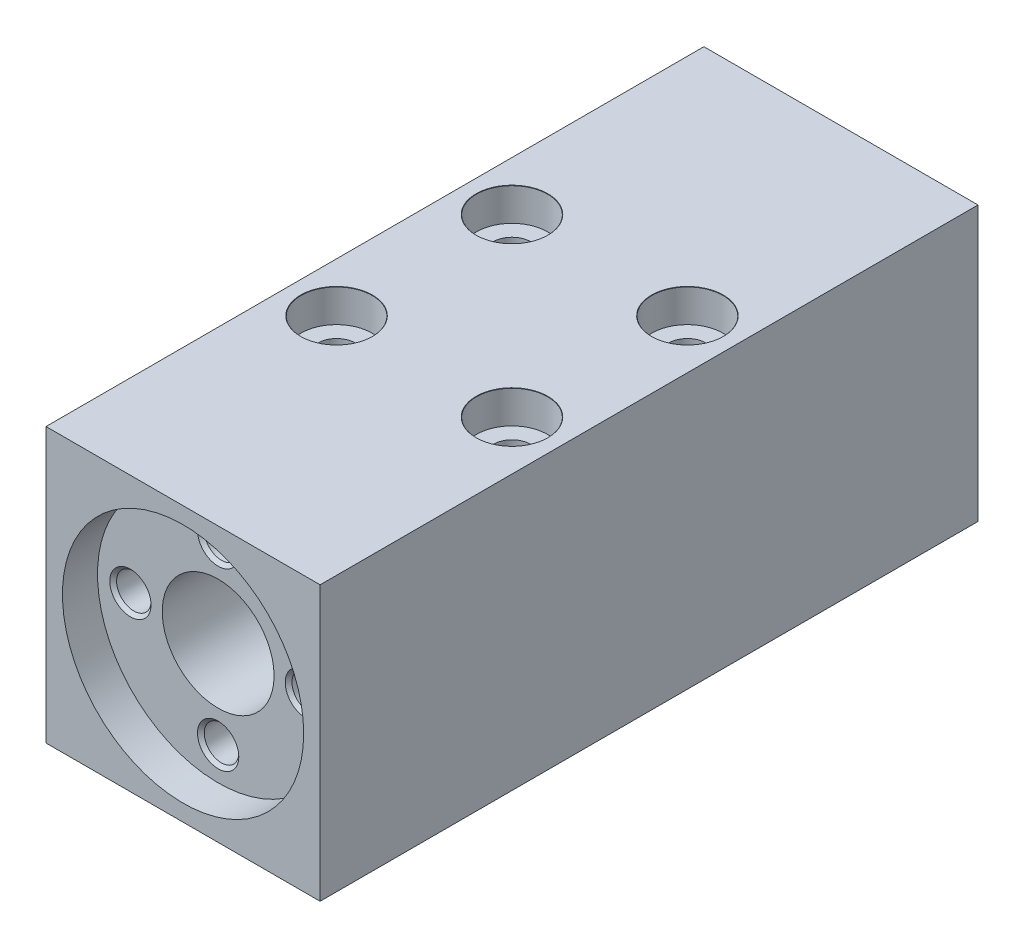
ISO-10303-21;
HEADER;
FILE_DESCRIPTION(('STEP AP214'),'2;1');
FILE_NAME('part.step','',(''),(''),'','','');
FILE_SCHEMA(('AUTOMOTIVE_DESIGN { 1 0 10303 214 1 1 1 1 }'));
ENDSEC;
DATA;
#1=APPLICATION_CONTEXT('core data for automotive mechanical design processes');
#2=APPLICATION_PROTOCOL_DEFINITION('international standard','automotive_design',2000,#1);
#3=PRODUCT_CONTEXT('',#1,'mechanical');
#4=PRODUCT('Part','Part','',(#3));
#5=PRODUCT_RELATED_PRODUCT_CATEGORY('part','',(#4));
#6=PRODUCT_DEFINITION_FORMATION('','',#4);
#7=PRODUCT_DEFINITION_CONTEXT('part definition',#1,'design');
#8=PRODUCT_DEFINITION('design','',#6,#7);
#9=PRODUCT_DEFINITION_SHAPE('','',#8);
#10=(LENGTH_UNIT() NAMED_UNIT(*) SI_UNIT(.MILLI.,.METRE.));
#11=(NAMED_UNIT(*) PLANE_ANGLE_UNIT() SI_UNIT($,.RADIAN.));
#12=(NAMED_UNIT(*) SI_UNIT($,.STERADIAN.) SOLID_ANGLE_UNIT());
#13=UNCERTAINTY_MEASURE_WITH_UNIT(LENGTH_MEASURE(1.E-05),#10,'distance_accuracy_value','');
#14=(GEOMETRIC_REPRESENTATION_CONTEXT(3) GLOBAL_UNCERTAINTY_ASSIGNED_CONTEXT((#13)) GLOBAL_UNIT_ASSIGNED_CONTEXT((#10,
#11,#12)) REPRESENTATION_CONTEXT('',''));
#15=CARTESIAN_POINT('',(0.,0.,0.));
#16=DIRECTION('',(0.,0.,1.));
#17=DIRECTION('',(1.,0.,0.));
#18=AXIS2_PLACEMENT_3D('',#15,#16,#17);
#19=CARTESIAN_POINT('',(0.,0.,0.));
#20=DIRECTION('',(0.,0.,1.));
#21=DIRECTION('',(1.,0.,0.));
#22=AXIS2_PLACEMENT_3D('',#19,#20,#21);
#23=CYLINDRICAL_SURFACE('',#22,5.1);
#24=CARTESIAN_POINT('',(0.,0.,0.));
#25=DIRECTION('',(0.,0.,1.));
#26=DIRECTION('',(1.,0.,0.));
#27=AXIS2_PLACEMENT_3D('',#24,#25,#26);
#28=CIRCLE('',#27,5.1);
#29=CARTESIAN_POINT('',(5.1,0.,0.));
#30=VERTEX_POINT('',#29);
#31=EDGE_CURVE('E168',#30,#30,#28,.T.);
#32=ORIENTED_EDGE('',*,*,#31,.F.);
#33=EDGE_LOOP('',(#32));
#34=FACE_BOUND('',#33,.T.);
#35=CARTESIAN_POINT('',(0.,0.,56.8));
#36=DIRECTION('',(0.,0.,1.));
#37=DIRECTION('',(1.,0.,0.));
#38=AXIS2_PLACEMENT_3D('',#35,#36,#37);
#39=CIRCLE('',#38,5.1);
#40=CARTESIAN_POINT('',(5.1,0.,56.8));
#41=VERTEX_POINT('',#40);
#42=EDGE_CURVE('E46',#41,#41,#39,.F.);
#43=ORIENTED_EDGE('',*,*,#42,.F.);
#44=EDGE_LOOP('',(#43));
#45=FACE_BOUND('',#44,.T.);
#46=ADVANCED_FACE('F42',(#34,#45),#23,.F.);
#47=CARTESIAN_POINT('',(-12.5,-12.5,60.));
#48=DIRECTION('',(1.,0.,0.));
#49=DIRECTION('',(0.,0.,-1.));
#50=AXIS2_PLACEMENT_3D('',#47,#48,#49);
#51=PLANE('',#50);
#52=DIRECTION('',(0.,-1.,0.));
#53=VECTOR('',#52,1.);
#54=CARTESIAN_POINT('',(-12.5,-12.5,0.));
#55=LINE('',#54,#53);
#56=CARTESIAN_POINT('',(-12.5,12.5,0.));
#57=VERTEX_POINT('',#56);
#58=CARTESIAN_POINT('',(-12.5,-12.5,0.));
#59=VERTEX_POINT('',#58);
#60=EDGE_CURVE('E172',#57,#59,#55,.T.);
#61=ORIENTED_EDGE('',*,*,#60,.T.);
#62=DIRECTION('',(0.,0.,-1.));
#63=VECTOR('',#62,1.);
#64=CARTESIAN_POINT('',(-12.5,-12.5,60.));
#65=LINE('',#64,#63);
#66=CARTESIAN_POINT('',(-12.5,-12.5,60.));
#67=VERTEX_POINT('',#66);
#68=EDGE_CURVE('E11',#67,#59,#65,.T.);
#69=ORIENTED_EDGE('',*,*,#68,.F.);
#70=DIRECTION('',(0.,-1.,0.));
#71=VECTOR('',#70,1.);
#72=CARTESIAN_POINT('',(-12.5,-12.5,60.));
#73=LINE('',#72,#71);
#74=CARTESIAN_POINT('',(-12.5,12.5,60.));
#75=VERTEX_POINT('',#74);
#76=EDGE_CURVE('E173',#75,#67,#73,.T.);
#77=ORIENTED_EDGE('',*,*,#76,.F.);
#78=DIRECTION('',(0.,0.,-1.));
#79=VECTOR('',#78,1.);
#80=CARTESIAN_POINT('',(-12.5,12.5,60.));
#81=LINE('',#80,#79);
#82=EDGE_CURVE('E183',#75,#57,#81,.T.);
#83=ORIENTED_EDGE('',*,*,#82,.T.);
#84=EDGE_LOOP('',(#61,#69,#77,#83));
#85=FACE_BOUND('',#84,.T.);
#86=ADVANCED_FACE('F44',(#85),#51,.F.);
#87=CARTESIAN_POINT('',(12.5,-12.5,60.));
#88=DIRECTION('',(0.,1.,0.));
#89=DIRECTION('',(-1.,0.,0.));
#90=AXIS2_PLACEMENT_3D('',#87,#88,#89);
#91=PLANE('',#90);
#92=CARTESIAN_POINT('',(-8.,-12.5,22.));
#93=DIRECTION('',(0.,1.,0.));
#94=DIRECTION('',(0.,0.,1.));
#95=AXIS2_PLACEMENT_3D('',#92,#93,#94);
#96=CIRCLE('',#95,1.69999999999999);
#97=CARTESIAN_POINT('',(-8.,-12.5,23.7));
#98=VERTEX_POINT('',#97);
#99=EDGE_CURVE('E376',#98,#98,#96,.T.);
#100=ORIENTED_EDGE('',*,*,#99,.T.);
#101=EDGE_LOOP('',(#100));
#102=FACE_BOUND('',#101,.T.);
#103=CARTESIAN_POINT('',(8.,-12.5,22.));
#104=DIRECTION('',(0.,1.,0.));
#105=DIRECTION('',(0.,0.,1.));
#106=AXIS2_PLACEMENT_3D('',#103,#104,#105);
#107=CIRCLE('',#106,1.69999999999999);
#108=CARTESIAN_POINT('',(8.,-12.5,23.7));
#109=VERTEX_POINT('',#108);
#110=EDGE_CURVE('E396',#109,#109,#107,.T.);
#111=ORIENTED_EDGE('',*,*,#110,.T.);
#112=EDGE_LOOP('',(#111));
#113=FACE_BOUND('',#112,.T.);
#114=CARTESIAN_POINT('',(-8.,-12.5,38.));
#115=DIRECTION('',(0.,1.,0.));
#116=DIRECTION('',(0.,0.,1.));
#117=AXIS2_PLACEMENT_3D('',#114,#115,#116);
#118=CIRCLE('',#117,1.69999999999999);
#119=CARTESIAN_POINT('',(-8.,-12.5,39.7));
#120=VERTEX_POINT('',#119);
#121=EDGE_CURVE('E416',#120,#120,#118,.T.);
#122=ORIENTED_EDGE('',*,*,#121,.T.);
#123=EDGE_LOOP('',(#122));
#124=FACE_BOUND('',#123,.T.);
#125=CARTESIAN_POINT('',(8.,-12.5,38.));
#126=DIRECTION('',(0.,1.,0.));
#127=DIRECTION('',(0.,0.,1.));
#128=AXIS2_PLACEMENT_3D('',#125,#126,#127);
#129=CIRCLE('',#128,1.69999999999999);
#130=CARTESIAN_POINT('',(8.,-12.5,39.7));
#131=VERTEX_POINT('',#130);
#132=EDGE_CURVE('E436',#131,#131,#129,.T.);
#133=ORIENTED_EDGE('',*,*,#132,.T.);
#134=EDGE_LOOP('',(#133));
#135=FACE_BOUND('',#134,.T.);
#136=DIRECTION('',(1.,0.,0.));
#137=VECTOR('',#136,1.);
#138=CARTESIAN_POINT('',(12.5,-12.5,0.));
#139=LINE('',#138,#137);
#140=CARTESIAN_POINT('',(12.5,-12.5,0.));
#141=VERTEX_POINT('',#140);
#142=EDGE_CURVE('E187',#59,#141,#139,.T.);
#143=ORIENTED_EDGE('',*,*,#142,.T.);
#144=DIRECTION('',(0.,0.,-1.));
#145=VECTOR('',#144,1.);
#146=CARTESIAN_POINT('',(12.5,-12.5,60.));
#147=LINE('',#146,#145);
#148=CARTESIAN_POINT('',(12.5,-12.5,60.));
#149=VERTEX_POINT('',#148);
#150=EDGE_CURVE('E53',#149,#141,#147,.T.);
#151=ORIENTED_EDGE('',*,*,#150,.F.);
#152=DIRECTION('',(1.,0.,0.));
#153=VECTOR('',#152,1.);
#154=CARTESIAN_POINT('',(12.5,-12.5,60.));
#155=LINE('',#154,#153);
#156=EDGE_CURVE('E92',#67,#149,#155,.T.);
#157=ORIENTED_EDGE('',*,*,#156,.F.);
#158=ORIENTED_EDGE('',*,*,#68,.T.);
#159=EDGE_LOOP('',(#143,#151,#157,#158));
#160=FACE_BOUND('',#159,.T.);
#161=ADVANCED_FACE('F221',(#102,#113,#124,#135,#160),#91,.F.);
#162=CARTESIAN_POINT('',(12.5,-12.5,60.));
#163=DIRECTION('',(-1.,0.,0.));
#164=DIRECTION('',(0.,0.,1.));
#165=AXIS2_PLACEMENT_3D('',#162,#163,#164);
#166=PLANE('',#165);
#167=DIRECTION('',(0.,1.,0.));
#168=VECTOR('',#167,1.);
#169=CARTESIAN_POINT('',(12.5,-12.5,0.));
#170=LINE('',#169,#168);
#171=CARTESIAN_POINT('',(12.5,12.5,0.));
#172=VERTEX_POINT('',#171);
#173=EDGE_CURVE('E79',#141,#172,#170,.T.);
#174=ORIENTED_EDGE('',*,*,#173,.T.);
#175=DIRECTION('',(0.,0.,-1.));
#176=VECTOR('',#175,1.);
#177=CARTESIAN_POINT('',(12.5,12.5,60.));
#178=LINE('',#177,#176);
#179=CARTESIAN_POINT('',(12.5,12.5,60.));
#180=VERTEX_POINT('',#179);
#181=EDGE_CURVE('E196',#180,#172,#178,.T.);
#182=ORIENTED_EDGE('',*,*,#181,.F.);
#183=DIRECTION('',(0.,1.,0.));
#184=VECTOR('',#183,1.);
#185=CARTESIAN_POINT('',(12.5,-12.5,60.));
#186=LINE('',#185,#184);
#187=EDGE_CURVE('E178',#149,#180,#186,.T.);
#188=ORIENTED_EDGE('',*,*,#187,.F.);
#189=ORIENTED_EDGE('',*,*,#150,.T.);
#190=EDGE_LOOP('',(#174,#182,#188,#189));
#191=FACE_BOUND('',#190,.T.);
#192=ADVANCED_FACE('F201',(#191),#166,.F.);
#193=CARTESIAN_POINT('',(12.5,12.5,60.));
#194=DIRECTION('',(0.,-1.,0.));
#195=DIRECTION('',(1.,0.,0.));
#196=AXIS2_PLACEMENT_3D('',#193,#194,#195);
#197=PLANE('',#196);
#198=CARTESIAN_POINT('',(-8.,12.5,22.));
#199=DIRECTION('',(0.,1.,0.));
#200=DIRECTION('',(0.,0.,1.));
#201=AXIS2_PLACEMENT_3D('',#198,#199,#200);
#202=CIRCLE('',#201,3.275);
#203=CARTESIAN_POINT('',(-8.,12.5,25.275));
#204=VERTEX_POINT('',#203);
#205=EDGE_CURVE('E362',#204,#204,#202,.T.);
#206=ORIENTED_EDGE('',*,*,#205,.F.);
#207=EDGE_LOOP('',(#206));
#208=FACE_BOUND('',#207,.T.);
#209=CARTESIAN_POINT('',(8.,12.5,22.));
#210=DIRECTION('',(0.,1.,0.));
#211=DIRECTION('',(0.,0.,1.));
#212=AXIS2_PLACEMENT_3D('',#209,#210,#211);
#213=CIRCLE('',#212,3.275);
#214=CARTESIAN_POINT('',(8.,12.5,25.275));
#215=VERTEX_POINT('',#214);
#216=EDGE_CURVE('E380',#215,#215,#213,.T.);
#217=ORIENTED_EDGE('',*,*,#216,.F.);
#218=EDGE_LOOP('',(#217));
#219=FACE_BOUND('',#218,.T.);
#220=CARTESIAN_POINT('',(-8.,12.5,38.));
#221=DIRECTION('',(0.,1.,0.));
#222=DIRECTION('',(0.,0.,1.));
#223=AXIS2_PLACEMENT_3D('',#220,#221,#222);
#224=CIRCLE('',#223,3.275);
#225=CARTESIAN_POINT('',(-8.,12.5,41.275));
#226=VERTEX_POINT('',#225);
#227=EDGE_CURVE('E400',#226,#226,#224,.T.);
#228=ORIENTED_EDGE('',*,*,#227,.F.);
#229=EDGE_LOOP('',(#228));
#230=FACE_BOUND('',#229,.T.);
#231=CARTESIAN_POINT('',(8.,12.5,38.));
#232=DIRECTION('',(0.,1.,0.));
#233=DIRECTION('',(0.,0.,1.));
#234=AXIS2_PLACEMENT_3D('',#231,#232,#233);
#235=CIRCLE('',#234,3.275);
#236=CARTESIAN_POINT('',(8.,12.5,41.275));
#237=VERTEX_POINT('',#236);
#238=EDGE_CURVE('E420',#237,#237,#235,.T.);
#239=ORIENTED_EDGE('',*,*,#238,.F.);
#240=EDGE_LOOP('',(#239));
#241=FACE_BOUND('',#240,.T.);
#242=DIRECTION('',(-1.,0.,0.));
#243=VECTOR('',#242,1.);
#244=CARTESIAN_POINT('',(12.5,12.5,0.));
#245=LINE('',#244,#243);
#246=EDGE_CURVE('E85',#172,#57,#245,.T.);
#247=ORIENTED_EDGE('',*,*,#246,.T.);
#248=ORIENTED_EDGE('',*,*,#82,.F.);
#249=DIRECTION('',(-1.,0.,0.));
#250=VECTOR('',#249,1.);
#251=CARTESIAN_POINT('',(12.5,12.5,60.));
#252=LINE('',#251,#250);
#253=EDGE_CURVE('E61',#180,#75,#252,.T.);
#254=ORIENTED_EDGE('',*,*,#253,.F.);
#255=ORIENTED_EDGE('',*,*,#181,.T.);
#256=EDGE_LOOP('',(#247,#248,#254,#255));
#257=FACE_BOUND('',#256,.T.);
#258=ADVANCED_FACE('F208',(#208,#219,#230,#241,#257),#197,.F.);
#259=CARTESIAN_POINT('',(0.,0.,60.));
#260=DIRECTION('',(0.,0.,1.));
#261=DIRECTION('',(1.,0.,0.));
#262=AXIS2_PLACEMENT_3D('',#259,#260,#261);
#263=PLANE('',#262);
#264=CARTESIAN_POINT('',(0.,0.,60.));
#265=DIRECTION('',(0.,0.,1.));
#266=DIRECTION('',(1.,0.,0.));
#267=AXIS2_PLACEMENT_3D('',#264,#265,#266);
#268=CIRCLE('',#267,11.);
#269=CARTESIAN_POINT('',(11.,0.,60.));
#270=VERTEX_POINT('',#269);
#271=EDGE_CURVE('E160',#270,#270,#268,.T.);
#272=ORIENTED_EDGE('',*,*,#271,.F.);
#273=EDGE_LOOP('',(#272));
#274=FACE_BOUND('',#273,.T.);
#275=ORIENTED_EDGE('',*,*,#76,.T.);
#276=ORIENTED_EDGE('',*,*,#156,.T.);
#277=ORIENTED_EDGE('',*,*,#187,.T.);
#278=ORIENTED_EDGE('',*,*,#253,.T.);
#279=EDGE_LOOP('',(#275,#276,#277,#278));
#280=FACE_BOUND('',#279,.T.);
#281=ADVANCED_FACE('F210',(#274,#280),#263,.T.);
#282=CARTESIAN_POINT('',(0.,0.,0.));
#283=DIRECTION('',(0.,0.,1.));
#284=DIRECTION('',(1.,0.,0.));
#285=AXIS2_PLACEMENT_3D('',#282,#283,#284);
#286=PLANE('',#285);
#287=ORIENTED_EDGE('',*,*,#31,.T.);
#288=EDGE_LOOP('',(#287));
#289=FACE_BOUND('',#288,.T.);
#290=ORIENTED_EDGE('',*,*,#60,.F.);
#291=ORIENTED_EDGE('',*,*,#246,.F.);
#292=ORIENTED_EDGE('',*,*,#173,.F.);
#293=ORIENTED_EDGE('',*,*,#142,.F.);
#294=EDGE_LOOP('',(#290,#291,#292,#293));
#295=FACE_BOUND('',#294,.T.);
#296=ADVANCED_FACE('F204',(#289,#295),#286,.F.);
#297=CARTESIAN_POINT('',(0.,0.,56.8));
#298=DIRECTION('',(0.,0.,1.));
#299=DIRECTION('',(1.,0.,0.));
#300=AXIS2_PLACEMENT_3D('',#297,#298,#299);
#301=PLANE('',#300);
#302=CARTESIAN_POINT('',(0.,8.,56.8));
#303=DIRECTION('',(0.,0.,1.));
#304=DIRECTION('',(1.,0.,0.));
#305=AXIS2_PLACEMENT_3D('',#302,#303,#304);
#306=CIRCLE('',#305,1.883);
#307=CARTESIAN_POINT('',(1.883,8.,56.8));
#308=VERTEX_POINT('',#307);
#309=EDGE_CURVE('E125',#308,#308,#306,.T.);
#310=ORIENTED_EDGE('',*,*,#309,.F.);
#311=EDGE_LOOP('',(#310));
#312=FACE_BOUND('',#311,.T.);
#313=CARTESIAN_POINT('',(8.00000000000023,2.25904099284255E-13,56.8));
#314=DIRECTION('',(0.,0.,1.));
#315=DIRECTION('',(1.,0.,0.));
#316=AXIS2_PLACEMENT_3D('',#313,#314,#315);
#317=CIRCLE('',#316,1.883);
#318=CARTESIAN_POINT('',(9.88300000000022,2.25904099284255E-13,56.8));
#319=VERTEX_POINT('',#318);
#320=EDGE_CURVE('E116',#319,#319,#317,.T.);
#321=ORIENTED_EDGE('',*,*,#320,.F.);
#322=EDGE_LOOP('',(#321));
#323=FACE_BOUND('',#322,.T.);
#324=CARTESIAN_POINT('',(4.51808198568511E-13,-8.,56.8));
#325=DIRECTION('',(0.,0.,1.));
#326=DIRECTION('',(1.,0.,0.));
#327=AXIS2_PLACEMENT_3D('',#324,#325,#326);
#328=CIRCLE('',#327,1.883);
#329=CARTESIAN_POINT('',(1.88300000000045,-8.,56.8));
#330=VERTEX_POINT('',#329);
#331=EDGE_CURVE('E136',#330,#330,#328,.T.);
#332=ORIENTED_EDGE('',*,*,#331,.F.);
#333=EDGE_LOOP('',(#332));
#334=FACE_BOUND('',#333,.T.);
#335=CARTESIAN_POINT('',(-7.99999999999977,-2.24924381844937E-13,56.8));
#336=DIRECTION('',(0.,0.,1.));
#337=DIRECTION('',(1.,0.,0.));
#338=AXIS2_PLACEMENT_3D('',#335,#336,#337);
#339=CIRCLE('',#338,1.883);
#340=CARTESIAN_POINT('',(-6.11699999999978,-2.24924381844937E-13,56.8));
#341=VERTEX_POINT('',#340);
#342=EDGE_CURVE('E148',#341,#341,#339,.T.);
#343=ORIENTED_EDGE('',*,*,#342,.F.);
#344=EDGE_LOOP('',(#343));
#345=FACE_BOUND('',#344,.T.);
#346=CARTESIAN_POINT('',(0.,0.,56.8));
#347=DIRECTION('',(0.,0.,1.));
#348=DIRECTION('',(1.,0.,0.));
#349=AXIS2_PLACEMENT_3D('',#346,#347,#348);
#350=CIRCLE('',#349,11.);
#351=CARTESIAN_POINT('',(11.,0.,56.8));
#352=VERTEX_POINT('',#351);
#353=EDGE_CURVE('E161',#352,#352,#350,.T.);
#354=ORIENTED_EDGE('',*,*,#353,.T.);
#355=EDGE_LOOP('',(#354));
#356=FACE_BOUND('',#355,.T.);
#357=ORIENTED_EDGE('',*,*,#42,.T.);
#358=EDGE_LOOP('',(#357));
#359=FACE_BOUND('',#358,.T.);
#360=ADVANCED_FACE('F238',(#312,#323,#334,#345,#356,#359),#301,.T.);
#361=CARTESIAN_POINT('',(0.,0.,56.8));
#362=DIRECTION('',(0.,0.,1.));
#363=DIRECTION('',(1.,0.,0.));
#364=AXIS2_PLACEMENT_3D('',#361,#362,#363);
#365=CYLINDRICAL_SURFACE('',#364,11.);
#366=ORIENTED_EDGE('',*,*,#353,.F.);
#367=EDGE_LOOP('',(#366));
#368=FACE_BOUND('',#367,.T.);
#369=ORIENTED_EDGE('',*,*,#271,.T.);
#370=EDGE_LOOP('',(#369));
#371=FACE_BOUND('',#370,.T.);
#372=ADVANCED_FACE('F235',(#368,#371),#365,.F.);
#373=CARTESIAN_POINT('',(-7.99999999999977,-2.24924381844937E-13,50.8));
#374=DIRECTION('',(0.,0.,1.));
#375=DIRECTION('',(1.,0.,0.));
#376=AXIS2_PLACEMENT_3D('',#373,#374,#375);
#377=CONICAL_SURFACE('',#376,1.575,1.02974425867665);
#378=CARTESIAN_POINT('',(-7.99999999999978,-2.24924381844937E-13,49.8536445250316));
#379=VERTEX_POINT('',#378);
#380=VERTEX_LOOP('',#379);
#381=FACE_BOUND('',#380,.T.);
#382=CARTESIAN_POINT('',(-7.99999999999977,-2.24924381844937E-13,50.8));
#383=DIRECTION('',(0.,0.,1.));
#384=DIRECTION('',(1.,0.,0.));
#385=AXIS2_PLACEMENT_3D('',#382,#383,#384);
#386=CIRCLE('',#385,1.575);
#387=CARTESIAN_POINT('',(-6.42499999999978,-2.24924381844937E-13,50.8));
#388=VERTEX_POINT('',#387);
#389=EDGE_CURVE('E156',#388,#388,#386,.T.);
#390=ORIENTED_EDGE('',*,*,#389,.T.);
#391=EDGE_LOOP('',(#390));
#392=FACE_BOUND('',#391,.T.);
#393=ADVANCED_FACE('F247',(#381,#392),#377,.F.);
#394=CARTESIAN_POINT('',(-7.99999999999977,-2.24924381844937E-13,56.8));
#395=DIRECTION('',(0.,0.,1.));
#396=DIRECTION('',(1.,0.,0.));
#397=AXIS2_PLACEMENT_3D('',#394,#395,#396);
#398=CYLINDRICAL_SURFACE('',#397,1.575);
#399=ORIENTED_EDGE('',*,*,#389,.F.);
#400=EDGE_LOOP('',(#399));
#401=FACE_BOUND('',#400,.T.);
#402=CARTESIAN_POINT('',(-7.99999999999977,-2.24924381844937E-13,56.492));
#403=DIRECTION('',(0.,0.,1.));
#404=DIRECTION('',(1.,0.,0.));
#405=AXIS2_PLACEMENT_3D('',#402,#403,#404);
#406=CIRCLE('',#405,1.575);
#407=CARTESIAN_POINT('',(-6.42499999999978,-2.24924381844937E-13,56.492));
#408=VERTEX_POINT('',#407);
#409=EDGE_CURVE('E152',#408,#408,#406,.T.);
#410=ORIENTED_EDGE('',*,*,#409,.T.);
#411=EDGE_LOOP('',(#410));
#412=FACE_BOUND('',#411,.T.);
#413=ADVANCED_FACE('F254',(#401,#412),#398,.F.);
#414=CARTESIAN_POINT('',(-7.99999999999977,-2.24924381844937E-13,56.8));
#415=DIRECTION('',(0.,0.,1.));
#416=DIRECTION('',(1.,0.,0.));
#417=AXIS2_PLACEMENT_3D('',#414,#415,#416);
#418=CONICAL_SURFACE('',#417,1.883,0.785398163397444);
#419=ORIENTED_EDGE('',*,*,#409,.F.);
#420=EDGE_LOOP('',(#419));
#421=FACE_BOUND('',#420,.T.);
#422=ORIENTED_EDGE('',*,*,#342,.T.);
#423=EDGE_LOOP('',(#422));
#424=FACE_BOUND('',#423,.T.);
#425=ADVANCED_FACE('F258',(#421,#424),#418,.F.);
#426=CARTESIAN_POINT('',(4.51808198568511E-13,-8.,50.8));
#427=DIRECTION('',(0.,0.,1.));
#428=DIRECTION('',(1.,0.,0.));
#429=AXIS2_PLACEMENT_3D('',#426,#427,#428);
#430=CONICAL_SURFACE('',#429,1.575,1.02974425867665);
#431=CARTESIAN_POINT('',(4.50106832168879E-13,-8.,49.8536445250316));
#432=VERTEX_POINT('',#431);
#433=VERTEX_LOOP('',#432);
#434=FACE_BOUND('',#433,.T.);
#435=CARTESIAN_POINT('',(4.51808198568511E-13,-8.,50.8));
#436=DIRECTION('',(0.,0.,1.));
#437=DIRECTION('',(1.,0.,0.));
#438=AXIS2_PLACEMENT_3D('',#435,#436,#437);
#439=CIRCLE('',#438,1.575);
#440=CARTESIAN_POINT('',(1.57500000000045,-8.,50.8));
#441=VERTEX_POINT('',#440);
#442=EDGE_CURVE('E144',#441,#441,#439,.T.);
#443=ORIENTED_EDGE('',*,*,#442,.T.);
#444=EDGE_LOOP('',(#443));
#445=FACE_BOUND('',#444,.T.);
#446=ADVANCED_FACE('F262',(#434,#445),#430,.F.);
#447=CARTESIAN_POINT('',(4.51808198568511E-13,-8.,56.8));
#448=DIRECTION('',(0.,0.,1.));
#449=DIRECTION('',(1.,0.,0.));
#450=AXIS2_PLACEMENT_3D('',#447,#448,#449);
#451=CYLINDRICAL_SURFACE('',#450,1.575);
#452=ORIENTED_EDGE('',*,*,#442,.F.);
#453=EDGE_LOOP('',(#452));
#454=FACE_BOUND('',#453,.T.);
#455=CARTESIAN_POINT('',(4.51808198568511E-13,-8.,56.492));
#456=DIRECTION('',(0.,0.,1.));
#457=DIRECTION('',(1.,0.,0.));
#458=AXIS2_PLACEMENT_3D('',#455,#456,#457);
#459=CIRCLE('',#458,1.575);
#460=CARTESIAN_POINT('',(1.57500000000045,-8.,56.492));
#461=VERTEX_POINT('',#460);
#462=EDGE_CURVE('E140',#461,#461,#459,.T.);
#463=ORIENTED_EDGE('',*,*,#462,.T.);
#464=EDGE_LOOP('',(#463));
#465=FACE_BOUND('',#464,.T.);
#466=ADVANCED_FACE('F266',(#454,#465),#451,.F.);
#467=CARTESIAN_POINT('',(4.51808198568511E-13,-8.,56.8));
#468=DIRECTION('',(0.,0.,1.));
#469=DIRECTION('',(1.,0.,0.));
#470=AXIS2_PLACEMENT_3D('',#467,#468,#469);
#471=CONICAL_SURFACE('',#470,1.883,0.785398163397444);
#472=ORIENTED_EDGE('',*,*,#462,.F.);
#473=EDGE_LOOP('',(#472));
#474=FACE_BOUND('',#473,.T.);
#475=ORIENTED_EDGE('',*,*,#331,.T.);
#476=EDGE_LOOP('',(#475));
#477=FACE_BOUND('',#476,.T.);
#478=ADVANCED_FACE('F270',(#474,#477),#471,.F.);
#479=CARTESIAN_POINT('',(8.00000000000023,2.25904099284255E-13,50.8));
#480=DIRECTION('',(0.,0.,1.));
#481=DIRECTION('',(1.,0.,0.));
#482=AXIS2_PLACEMENT_3D('',#479,#480,#481);
#483=CONICAL_SURFACE('',#482,1.575,1.02974425867665);
#484=CARTESIAN_POINT('',(8.00000000000022,2.25904099284255E-13,49.8536445250316));
#485=VERTEX_POINT('',#484);
#486=VERTEX_LOOP('',#485);
#487=FACE_BOUND('',#486,.T.);
#488=CARTESIAN_POINT('',(8.00000000000023,2.25904099284255E-13,50.8));
#489=DIRECTION('',(0.,0.,1.));
#490=DIRECTION('',(1.,0.,0.));
#491=AXIS2_PLACEMENT_3D('',#488,#489,#490);
#492=CIRCLE('',#491,1.575);
#493=CARTESIAN_POINT('',(9.57500000000022,2.25904099284255E-13,50.8));
#494=VERTEX_POINT('',#493);
#495=EDGE_CURVE('E132',#494,#494,#492,.T.);
#496=ORIENTED_EDGE('',*,*,#495,.T.);
#497=EDGE_LOOP('',(#496));
#498=FACE_BOUND('',#497,.T.);
#499=ADVANCED_FACE('F274',(#487,#498),#483,.F.);
#500=CARTESIAN_POINT('',(8.00000000000023,2.25904099284255E-13,56.8));
#501=DIRECTION('',(0.,0.,1.));
#502=DIRECTION('',(1.,0.,0.));
#503=AXIS2_PLACEMENT_3D('',#500,#501,#502);
#504=CYLINDRICAL_SURFACE('',#503,1.575);
#505=ORIENTED_EDGE('',*,*,#495,.F.);
#506=EDGE_LOOP('',(#505));
#507=FACE_BOUND('',#506,.T.);
#508=CARTESIAN_POINT('',(8.00000000000023,2.25904099284255E-13,56.492));
#509=DIRECTION('',(0.,0.,1.));
#510=DIRECTION('',(1.,0.,0.));
#511=AXIS2_PLACEMENT_3D('',#508,#509,#510);
#512=CIRCLE('',#511,1.575);
#513=CARTESIAN_POINT('',(9.57500000000022,2.25904099284255E-13,56.492));
#514=VERTEX_POINT('',#513);
#515=EDGE_CURVE('E122',#514,#514,#512,.T.);
#516=ORIENTED_EDGE('',*,*,#515,.T.);
#517=EDGE_LOOP('',(#516));
#518=FACE_BOUND('',#517,.T.);
#519=ADVANCED_FACE('F278',(#507,#518),#504,.F.);
#520=CARTESIAN_POINT('',(8.00000000000023,2.25904099284255E-13,56.8));
#521=DIRECTION('',(0.,0.,1.));
#522=DIRECTION('',(1.,0.,0.));
#523=AXIS2_PLACEMENT_3D('',#520,#521,#522);
#524=CONICAL_SURFACE('',#523,1.883,0.785398163397443);
#525=ORIENTED_EDGE('',*,*,#515,.F.);
#526=EDGE_LOOP('',(#525));
#527=FACE_BOUND('',#526,.T.);
#528=ORIENTED_EDGE('',*,*,#320,.T.);
#529=EDGE_LOOP('',(#528));
#530=FACE_BOUND('',#529,.T.);
#531=ADVANCED_FACE('F109',(#527,#530),#524,.F.);
#532=CARTESIAN_POINT('',(0.,8.,50.8));
#533=DIRECTION('',(0.,0.,1.));
#534=DIRECTION('',(1.,0.,0.));
#535=AXIS2_PLACEMENT_3D('',#532,#533,#534);
#536=CONICAL_SURFACE('',#535,1.575,1.02974425867665);
#537=CARTESIAN_POINT('',(0.,8.,49.8536445250316));
#538=VERTEX_POINT('',#537);
#539=VERTEX_LOOP('',#538);
#540=FACE_BOUND('',#539,.T.);
#541=CARTESIAN_POINT('',(0.,8.,50.8));
#542=DIRECTION('',(0.,0.,1.));
#543=DIRECTION('',(1.,0.,0.));
#544=AXIS2_PLACEMENT_3D('',#541,#542,#543);
#545=CIRCLE('',#544,1.575);
#546=CARTESIAN_POINT('',(1.575,8.,50.8));
#547=VERTEX_POINT('',#546);
#548=EDGE_CURVE('E113',#547,#547,#545,.T.);
#549=ORIENTED_EDGE('',*,*,#548,.T.);
#550=EDGE_LOOP('',(#549));
#551=FACE_BOUND('',#550,.T.);
#552=ADVANCED_FACE('F105',(#540,#551),#536,.F.);
#553=CARTESIAN_POINT('',(0.,8.,56.8));
#554=DIRECTION('',(0.,0.,1.));
#555=DIRECTION('',(1.,0.,0.));
#556=AXIS2_PLACEMENT_3D('',#553,#554,#555);
#557=CYLINDRICAL_SURFACE('',#556,1.575);
#558=ORIENTED_EDGE('',*,*,#548,.F.);
#559=EDGE_LOOP('',(#558));
#560=FACE_BOUND('',#559,.T.);
#561=CARTESIAN_POINT('',(0.,8.,56.492));
#562=DIRECTION('',(0.,0.,1.));
#563=DIRECTION('',(1.,0.,0.));
#564=AXIS2_PLACEMENT_3D('',#561,#562,#563);
#565=CIRCLE('',#564,1.575);
#566=CARTESIAN_POINT('',(1.575,8.,56.492));
#567=VERTEX_POINT('',#566);
#568=EDGE_CURVE('E117',#567,#567,#565,.T.);
#569=ORIENTED_EDGE('',*,*,#568,.T.);
#570=EDGE_LOOP('',(#569));
#571=FACE_BOUND('',#570,.T.);
#572=ADVANCED_FACE('F108',(#560,#571),#557,.F.);
#573=CARTESIAN_POINT('',(0.,8.,56.8));
#574=DIRECTION('',(0.,0.,1.));
#575=DIRECTION('',(1.,0.,0.));
#576=AXIS2_PLACEMENT_3D('',#573,#574,#575);
#577=CONICAL_SURFACE('',#576,1.883,0.785398163397444);
#578=ORIENTED_EDGE('',*,*,#568,.F.);
#579=EDGE_LOOP('',(#578));
#580=FACE_BOUND('',#579,.T.);
#581=ORIENTED_EDGE('',*,*,#309,.T.);
#582=EDGE_LOOP('',(#581));
#583=FACE_BOUND('',#582,.T.);
#584=ADVANCED_FACE('F288',(#580,#583),#577,.F.);
#585=CARTESIAN_POINT('',(8.,12.5,38.));
#586=DIRECTION('',(0.,1.,0.));
#587=DIRECTION('',(0.,0.,1.));
#588=AXIS2_PLACEMENT_3D('',#585,#586,#587);
#589=CYLINDRICAL_SURFACE('',#588,1.7);
#590=ORIENTED_EDGE('',*,*,#132,.F.);
#591=EDGE_LOOP('',(#590));
#592=FACE_BOUND('',#591,.T.);
#593=CARTESIAN_POINT('',(8.,9.50000000000002,38.));
#594=DIRECTION('',(0.,1.,0.));
#595=DIRECTION('',(0.,0.,1.));
#596=AXIS2_PLACEMENT_3D('',#593,#594,#595);
#597=CIRCLE('',#596,1.70000000000001);
#598=CARTESIAN_POINT('',(8.,9.50000000000002,39.7));
#599=VERTEX_POINT('',#598);
#600=EDGE_CURVE('E432',#599,#599,#597,.T.);
#601=ORIENTED_EDGE('',*,*,#600,.T.);
#602=EDGE_LOOP('',(#601));
#603=FACE_BOUND('',#602,.T.);
#604=ADVANCED_FACE('F291',(#592,#603),#589,.F.);
#605=CARTESIAN_POINT('',(11.25,9.50000000000002,38.));
#606=DIRECTION('',(0.,-1.,0.));
#607=DIRECTION('',(0.,0.,-1.));
#608=AXIS2_PLACEMENT_3D('',#605,#606,#607);
#609=PLANE('',#608);
#610=ORIENTED_EDGE('',*,*,#600,.F.);
#611=EDGE_LOOP('',(#610));
#612=FACE_BOUND('',#611,.T.);
#613=CARTESIAN_POINT('',(8.,9.50000000000002,38.));
#614=DIRECTION('',(0.,1.,0.));
#615=DIRECTION('',(0.,0.,1.));
#616=AXIS2_PLACEMENT_3D('',#613,#614,#615);
#617=CIRCLE('',#616,3.25);
#618=CARTESIAN_POINT('',(8.,9.50000000000002,41.25));
#619=VERTEX_POINT('',#618);
#620=EDGE_CURVE('E428',#619,#619,#617,.T.);
#621=ORIENTED_EDGE('',*,*,#620,.T.);
#622=EDGE_LOOP('',(#621));
#623=FACE_BOUND('',#622,.T.);
#624=ADVANCED_FACE('F295',(#612,#623),#609,.F.);
#625=CARTESIAN_POINT('',(8.,12.5,38.));
#626=DIRECTION('',(0.,1.,0.));
#627=DIRECTION('',(0.,0.,1.));
#628=AXIS2_PLACEMENT_3D('',#625,#626,#627);
#629=CYLINDRICAL_SURFACE('',#628,3.25);
#630=ORIENTED_EDGE('',*,*,#620,.F.);
#631=EDGE_LOOP('',(#630));
#632=FACE_BOUND('',#631,.T.);
#633=CARTESIAN_POINT('',(8.,12.475,38.));
#634=DIRECTION('',(0.,1.,0.));
#635=DIRECTION('',(0.,0.,1.));
#636=AXIS2_PLACEMENT_3D('',#633,#634,#635);
#637=CIRCLE('',#636,3.25);
#638=CARTESIAN_POINT('',(8.,12.475,41.25));
#639=VERTEX_POINT('',#638);
#640=EDGE_CURVE('E424',#639,#639,#637,.T.);
#641=ORIENTED_EDGE('',*,*,#640,.T.);
#642=EDGE_LOOP('',(#641));
#643=FACE_BOUND('',#642,.T.);
#644=ADVANCED_FACE('F299',(#632,#643),#629,.F.);
#645=CARTESIAN_POINT('',(8.,12.5,38.));
#646=DIRECTION('',(0.,1.,0.));
#647=DIRECTION('',(0.,0.,1.));
#648=AXIS2_PLACEMENT_3D('',#645,#646,#647);
#649=CONICAL_SURFACE('',#648,3.275,0.785398163397622);
#650=ORIENTED_EDGE('',*,*,#640,.F.);
#651=EDGE_LOOP('',(#650));
#652=FACE_BOUND('',#651,.T.);
#653=ORIENTED_EDGE('',*,*,#238,.T.);
#654=EDGE_LOOP('',(#653));
#655=FACE_BOUND('',#654,.T.);
#656=ADVANCED_FACE('F303',(#652,#655),#649,.F.);
#657=CARTESIAN_POINT('',(-8.,12.5,38.));
#658=DIRECTION('',(0.,1.,0.));
#659=DIRECTION('',(0.,0.,1.));
#660=AXIS2_PLACEMENT_3D('',#657,#658,#659);
#661=CYLINDRICAL_SURFACE('',#660,1.7);
#662=ORIENTED_EDGE('',*,*,#121,.F.);
#663=EDGE_LOOP('',(#662));
#664=FACE_BOUND('',#663,.T.);
#665=CARTESIAN_POINT('',(-8.,9.50000000000001,38.));
#666=DIRECTION('',(0.,1.,0.));
#667=DIRECTION('',(0.,0.,1.));
#668=AXIS2_PLACEMENT_3D('',#665,#666,#667);
#669=CIRCLE('',#668,1.70000000000001);
#670=CARTESIAN_POINT('',(-8.,9.50000000000001,39.7));
#671=VERTEX_POINT('',#670);
#672=EDGE_CURVE('E412',#671,#671,#669,.T.);
#673=ORIENTED_EDGE('',*,*,#672,.T.);
#674=EDGE_LOOP('',(#673));
#675=FACE_BOUND('',#674,.T.);
#676=ADVANCED_FACE('F307',(#664,#675),#661,.F.);
#677=CARTESIAN_POINT('',(-4.75,9.50000000000001,38.));
#678=DIRECTION('',(0.,-1.,0.));
#679=DIRECTION('',(0.,0.,-1.));
#680=AXIS2_PLACEMENT_3D('',#677,#678,#679);
#681=PLANE('',#680);
#682=ORIENTED_EDGE('',*,*,#672,.F.);
#683=EDGE_LOOP('',(#682));
#684=FACE_BOUND('',#683,.T.);
#685=CARTESIAN_POINT('',(-8.,9.50000000000001,38.));
#686=DIRECTION('',(0.,1.,0.));
#687=DIRECTION('',(0.,0.,1.));
#688=AXIS2_PLACEMENT_3D('',#685,#686,#687);
#689=CIRCLE('',#688,3.25);
#690=CARTESIAN_POINT('',(-8.,9.50000000000001,41.25));
#691=VERTEX_POINT('',#690);
#692=EDGE_CURVE('E408',#691,#691,#689,.T.);
#693=ORIENTED_EDGE('',*,*,#692,.T.);
#694=EDGE_LOOP('',(#693));
#695=FACE_BOUND('',#694,.T.);
#696=ADVANCED_FACE('F311',(#684,#695),#681,.F.);
#697=CARTESIAN_POINT('',(-8.,12.5,38.));
#698=DIRECTION('',(0.,1.,0.));
#699=DIRECTION('',(0.,0.,1.));
#700=AXIS2_PLACEMENT_3D('',#697,#698,#699);
#701=CYLINDRICAL_SURFACE('',#700,3.25);
#702=ORIENTED_EDGE('',*,*,#692,.F.);
#703=EDGE_LOOP('',(#702));
#704=FACE_BOUND('',#703,.T.);
#705=CARTESIAN_POINT('',(-8.,12.475,38.));
#706=DIRECTION('',(0.,1.,0.));
#707=DIRECTION('',(0.,0.,1.));
#708=AXIS2_PLACEMENT_3D('',#705,#706,#707);
#709=CIRCLE('',#708,3.25);
#710=CARTESIAN_POINT('',(-8.,12.475,41.25));
#711=VERTEX_POINT('',#710);
#712=EDGE_CURVE('E404',#711,#711,#709,.T.);
#713=ORIENTED_EDGE('',*,*,#712,.T.);
#714=EDGE_LOOP('',(#713));
#715=FACE_BOUND('',#714,.T.);
#716=ADVANCED_FACE('F315',(#704,#715),#701,.F.);
#717=CARTESIAN_POINT('',(-8.,12.5,38.));
#718=DIRECTION('',(0.,1.,0.));
#719=DIRECTION('',(0.,0.,1.));
#720=AXIS2_PLACEMENT_3D('',#717,#718,#719);
#721=CONICAL_SURFACE('',#720,3.275,0.785398163397622);
#722=ORIENTED_EDGE('',*,*,#712,.F.);
#723=EDGE_LOOP('',(#722));
#724=FACE_BOUND('',#723,.T.);
#725=ORIENTED_EDGE('',*,*,#227,.T.);
#726=EDGE_LOOP('',(#725));
#727=FACE_BOUND('',#726,.T.);
#728=ADVANCED_FACE('F319',(#724,#727),#721,.F.);
#729=CARTESIAN_POINT('',(8.,12.5,22.));
#730=DIRECTION('',(0.,1.,0.));
#731=DIRECTION('',(0.,0.,1.));
#732=AXIS2_PLACEMENT_3D('',#729,#730,#731);
#733=CYLINDRICAL_SURFACE('',#732,1.7);
#734=ORIENTED_EDGE('',*,*,#110,.F.);
#735=EDGE_LOOP('',(#734));
#736=FACE_BOUND('',#735,.T.);
#737=CARTESIAN_POINT('',(8.,9.50000000000002,22.));
#738=DIRECTION('',(0.,1.,0.));
#739=DIRECTION('',(0.,0.,1.));
#740=AXIS2_PLACEMENT_3D('',#737,#738,#739);
#741=CIRCLE('',#740,1.70000000000001);
#742=CARTESIAN_POINT('',(8.,9.50000000000002,23.7));
#743=VERTEX_POINT('',#742);
#744=EDGE_CURVE('E392',#743,#743,#741,.T.);
#745=ORIENTED_EDGE('',*,*,#744,.T.);
#746=EDGE_LOOP('',(#745));
#747=FACE_BOUND('',#746,.T.);
#748=ADVANCED_FACE('F323',(#736,#747),#733,.F.);
#749=CARTESIAN_POINT('',(11.25,9.50000000000002,22.));
#750=DIRECTION('',(0.,-1.,0.));
#751=DIRECTION('',(0.,0.,-1.));
#752=AXIS2_PLACEMENT_3D('',#749,#750,#751);
#753=PLANE('',#752);
#754=ORIENTED_EDGE('',*,*,#744,.F.);
#755=EDGE_LOOP('',(#754));
#756=FACE_BOUND('',#755,.T.);
#757=CARTESIAN_POINT('',(8.,9.50000000000002,22.));
#758=DIRECTION('',(0.,1.,0.));
#759=DIRECTION('',(0.,0.,1.));
#760=AXIS2_PLACEMENT_3D('',#757,#758,#759);
#761=CIRCLE('',#760,3.25);
#762=CARTESIAN_POINT('',(8.,9.50000000000002,25.25));
#763=VERTEX_POINT('',#762);
#764=EDGE_CURVE('E388',#763,#763,#761,.T.);
#765=ORIENTED_EDGE('',*,*,#764,.T.);
#766=EDGE_LOOP('',(#765));
#767=FACE_BOUND('',#766,.T.);
#768=ADVANCED_FACE('F327',(#756,#767),#753,.F.);
#769=CARTESIAN_POINT('',(8.,12.5,22.));
#770=DIRECTION('',(0.,1.,0.));
#771=DIRECTION('',(0.,0.,1.));
#772=AXIS2_PLACEMENT_3D('',#769,#770,#771);
#773=CYLINDRICAL_SURFACE('',#772,3.25);
#774=ORIENTED_EDGE('',*,*,#764,.F.);
#775=EDGE_LOOP('',(#774));
#776=FACE_BOUND('',#775,.T.);
#777=CARTESIAN_POINT('',(8.,12.475,22.));
#778=DIRECTION('',(0.,1.,0.));
#779=DIRECTION('',(0.,0.,1.));
#780=AXIS2_PLACEMENT_3D('',#777,#778,#779);
#781=CIRCLE('',#780,3.25);
#782=CARTESIAN_POINT('',(8.,12.475,25.25));
#783=VERTEX_POINT('',#782);
#784=EDGE_CURVE('E384',#783,#783,#781,.T.);
#785=ORIENTED_EDGE('',*,*,#784,.T.);
#786=EDGE_LOOP('',(#785));
#787=FACE_BOUND('',#786,.T.);
#788=ADVANCED_FACE('F331',(#776,#787),#773,.F.);
#789=CARTESIAN_POINT('',(8.,12.5,22.));
#790=DIRECTION('',(0.,1.,0.));
#791=DIRECTION('',(0.,0.,1.));
#792=AXIS2_PLACEMENT_3D('',#789,#790,#791);
#793=CONICAL_SURFACE('',#792,3.275,0.785398163397622);
#794=ORIENTED_EDGE('',*,*,#784,.F.);
#795=EDGE_LOOP('',(#794));
#796=FACE_BOUND('',#795,.T.);
#797=ORIENTED_EDGE('',*,*,#216,.T.);
#798=EDGE_LOOP('',(#797));
#799=FACE_BOUND('',#798,.T.);
#800=ADVANCED_FACE('F335',(#796,#799),#793,.F.);
#801=CARTESIAN_POINT('',(-8.,12.5,22.));
#802=DIRECTION('',(0.,1.,0.));
#803=DIRECTION('',(0.,0.,1.));
#804=AXIS2_PLACEMENT_3D('',#801,#802,#803);
#805=CYLINDRICAL_SURFACE('',#804,1.7);
#806=ORIENTED_EDGE('',*,*,#99,.F.);
#807=EDGE_LOOP('',(#806));
#808=FACE_BOUND('',#807,.T.);
#809=CARTESIAN_POINT('',(-8.,9.50000000000001,22.));
#810=DIRECTION('',(0.,1.,0.));
#811=DIRECTION('',(0.,0.,1.));
#812=AXIS2_PLACEMENT_3D('',#809,#810,#811);
#813=CIRCLE('',#812,1.70000000000001);
#814=CARTESIAN_POINT('',(-8.,9.50000000000001,23.7));
#815=VERTEX_POINT('',#814);
#816=EDGE_CURVE('E372',#815,#815,#813,.T.);
#817=ORIENTED_EDGE('',*,*,#816,.T.);
#818=EDGE_LOOP('',(#817));
#819=FACE_BOUND('',#818,.T.);
#820=ADVANCED_FACE('F339',(#808,#819),#805,.F.);
#821=CARTESIAN_POINT('',(-4.75,9.50000000000001,22.));
#822=DIRECTION('',(0.,-1.,0.));
#823=DIRECTION('',(0.,0.,-1.));
#824=AXIS2_PLACEMENT_3D('',#821,#822,#823);
#825=PLANE('',#824);
#826=ORIENTED_EDGE('',*,*,#816,.F.);
#827=EDGE_LOOP('',(#826));
#828=FACE_BOUND('',#827,.T.);
#829=CARTESIAN_POINT('',(-8.,9.50000000000001,22.));
#830=DIRECTION('',(0.,1.,0.));
#831=DIRECTION('',(0.,0.,1.));
#832=AXIS2_PLACEMENT_3D('',#829,#830,#831);
#833=CIRCLE('',#832,3.25);
#834=CARTESIAN_POINT('',(-8.,9.50000000000001,25.25));
#835=VERTEX_POINT('',#834);
#836=EDGE_CURVE('E366',#835,#835,#833,.T.);
#837=ORIENTED_EDGE('',*,*,#836,.T.);
#838=EDGE_LOOP('',(#837));
#839=FACE_BOUND('',#838,.T.);
#840=ADVANCED_FACE('F343',(#828,#839),#825,.F.);
#841=CARTESIAN_POINT('',(-8.,12.5,22.));
#842=DIRECTION('',(0.,1.,0.));
#843=DIRECTION('',(0.,0.,1.));
#844=AXIS2_PLACEMENT_3D('',#841,#842,#843);
#845=CYLINDRICAL_SURFACE('',#844,3.25);
#846=ORIENTED_EDGE('',*,*,#836,.F.);
#847=EDGE_LOOP('',(#846));
#848=FACE_BOUND('',#847,.T.);
#849=CARTESIAN_POINT('',(-8.,12.475,22.));
#850=DIRECTION('',(0.,1.,0.));
#851=DIRECTION('',(0.,0.,1.));
#852=AXIS2_PLACEMENT_3D('',#849,#850,#851);
#853=CIRCLE('',#852,3.25);
#854=CARTESIAN_POINT('',(-8.,12.475,25.25));
#855=VERTEX_POINT('',#854);
#856=EDGE_CURVE('E360',#855,#855,#853,.T.);
#857=ORIENTED_EDGE('',*,*,#856,.T.);
#858=EDGE_LOOP('',(#857));
#859=FACE_BOUND('',#858,.T.);
#860=ADVANCED_FACE('F347',(#848,#859),#845,.F.);
#861=CARTESIAN_POINT('',(-8.,12.5,22.));
#862=DIRECTION('',(0.,1.,0.));
#863=DIRECTION('',(0.,0.,1.));
#864=AXIS2_PLACEMENT_3D('',#861,#862,#863);
#865=CONICAL_SURFACE('',#864,3.275,0.785398163397622);
#866=ORIENTED_EDGE('',*,*,#856,.F.);
#867=EDGE_LOOP('',(#866));
#868=FACE_BOUND('',#867,.T.);
#869=ORIENTED_EDGE('',*,*,#205,.T.);
#870=EDGE_LOOP('',(#869));
#871=FACE_BOUND('',#870,.T.);
#872=ADVANCED_FACE('F351',(#868,#871),#865,.F.);
#873=CLOSED_SHELL('',(#46,#86,#161,#192,#258,#281,#296,#360,#372,#393,#413,#425,#446,#466,#478,
#499,#519,#531,#552,#572,#584,#604,#624,#644,#656,#676,#696,#716,#728,#748,#768,#788,#800,#820,
#840,#860,#872));
#874=MANIFOLD_SOLID_BREP('B2',#873);
#875=ADVANCED_BREP_SHAPE_REPRESENTATION('',(#18,#874),#14);
#876=SHAPE_DEFINITION_REPRESENTATION(#9,#875);
ENDSEC;
END-ISO-10303-21;
